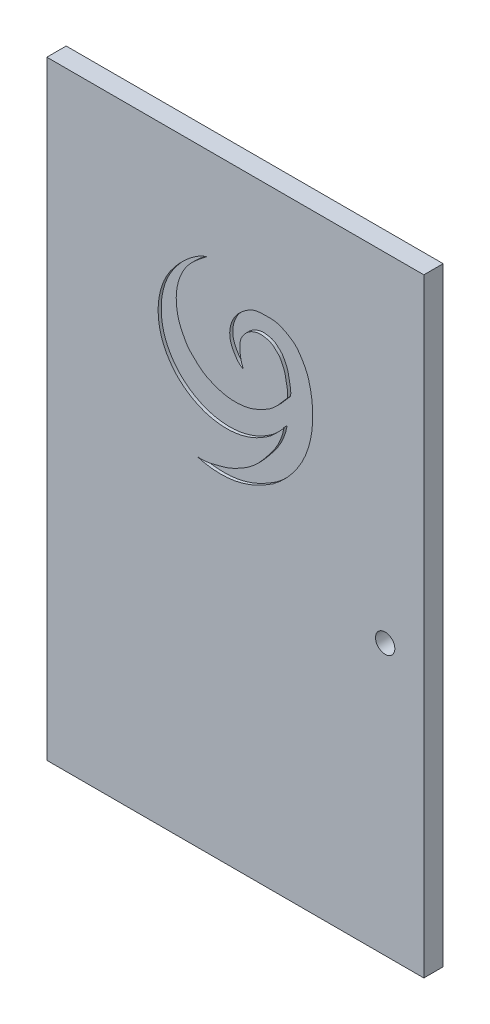
ISO-10303-21;
HEADER;
FILE_DESCRIPTION(('STEP AP214'),'2;1');
FILE_NAME('part.step','',(''),(''),'','','');
FILE_SCHEMA(('AUTOMOTIVE_DESIGN { 1 0 10303 214 1 1 1 1 }'));
ENDSEC;
DATA;
#1=APPLICATION_CONTEXT('core data for automotive mechanical design processes');
#2=APPLICATION_PROTOCOL_DEFINITION('international standard','automotive_design',2000,#1);
#3=PRODUCT_CONTEXT('',#1,'mechanical');
#4=PRODUCT('Part','Part','',(#3));
#5=PRODUCT_RELATED_PRODUCT_CATEGORY('part','',(#4));
#6=PRODUCT_DEFINITION_FORMATION('','',#4);
#7=PRODUCT_DEFINITION_CONTEXT('part definition',#1,'design');
#8=PRODUCT_DEFINITION('design','',#6,#7);
#9=PRODUCT_DEFINITION_SHAPE('','',#8);
#10=(LENGTH_UNIT() NAMED_UNIT(*) SI_UNIT(.MILLI.,.METRE.));
#11=(NAMED_UNIT(*) PLANE_ANGLE_UNIT() SI_UNIT($,.RADIAN.));
#12=(NAMED_UNIT(*) SI_UNIT($,.STERADIAN.) SOLID_ANGLE_UNIT());
#13=UNCERTAINTY_MEASURE_WITH_UNIT(LENGTH_MEASURE(1.E-05),#10,'distance_accuracy_value','');
#14=(GEOMETRIC_REPRESENTATION_CONTEXT(3) GLOBAL_UNCERTAINTY_ASSIGNED_CONTEXT((#13)) GLOBAL_UNIT_ASSIGNED_CONTEXT((#10,
#11,#12)) REPRESENTATION_CONTEXT('',''));
#15=CARTESIAN_POINT('',(0.,0.,0.));
#16=DIRECTION('',(0.,0.,1.));
#17=DIRECTION('',(1.,0.,0.));
#18=AXIS2_PLACEMENT_3D('',#15,#16,#17);
#19=CARTESIAN_POINT('',(-61.9125,200.025,6.35));
#20=DIRECTION('',(1.,0.,0.));
#21=DIRECTION('',(0.,0.,-1.));
#22=AXIS2_PLACEMENT_3D('',#19,#20,#21);
#23=PLANE('',#22);
#24=DIRECTION('',(0.,-1.,0.));
#25=VECTOR('',#24,1.);
#26=CARTESIAN_POINT('',(-61.9125,200.025,0.));
#27=LINE('',#26,#25);
#28=CARTESIAN_POINT('',(-61.9125,200.025,0.));
#29=VERTEX_POINT('',#28);
#30=CARTESIAN_POINT('',(-61.9125,0.,0.));
#31=VERTEX_POINT('',#30);
#32=EDGE_CURVE('E186',#29,#31,#27,.T.);
#33=ORIENTED_EDGE('',*,*,#32,.T.);
#34=DIRECTION('',(0.,0.,-1.));
#35=VECTOR('',#34,1.);
#36=CARTESIAN_POINT('',(-61.9125,0.,6.35));
#37=LINE('',#36,#35);
#38=CARTESIAN_POINT('',(-61.9125,0.,6.35));
#39=VERTEX_POINT('',#38);
#40=EDGE_CURVE('E11',#39,#31,#37,.T.);
#41=ORIENTED_EDGE('',*,*,#40,.F.);
#42=DIRECTION('',(0.,-1.,0.));
#43=VECTOR('',#42,1.);
#44=CARTESIAN_POINT('',(-61.9125,200.025,6.35));
#45=LINE('',#44,#43);
#46=CARTESIAN_POINT('',(-61.9125,200.025,6.35));
#47=VERTEX_POINT('',#46);
#48=EDGE_CURVE('E192',#47,#39,#45,.T.);
#49=ORIENTED_EDGE('',*,*,#48,.F.);
#50=DIRECTION('',(0.,0.,-1.));
#51=VECTOR('',#50,1.);
#52=CARTESIAN_POINT('',(-61.9125,200.025,6.35));
#53=LINE('',#52,#51);
#54=EDGE_CURVE('E196',#47,#29,#53,.T.);
#55=ORIENTED_EDGE('',*,*,#54,.T.);
#56=EDGE_LOOP('',(#33,#41,#49,#55));
#57=FACE_BOUND('',#56,.T.);
#58=ADVANCED_FACE('F33',(#57),#23,.F.);
#59=CARTESIAN_POINT('',(-61.9125,0.,6.35));
#60=DIRECTION('',(0.,1.,0.));
#61=DIRECTION('',(0.,0.,1.));
#62=AXIS2_PLACEMENT_3D('',#59,#60,#61);
#63=PLANE('',#62);
#64=DIRECTION('',(1.,0.,0.));
#65=VECTOR('',#64,1.);
#66=CARTESIAN_POINT('',(-61.9125,0.,0.));
#67=LINE('',#66,#65);
#68=CARTESIAN_POINT('',(61.9125,0.,0.));
#69=VERTEX_POINT('',#68);
#70=EDGE_CURVE('E177',#31,#69,#67,.T.);
#71=ORIENTED_EDGE('',*,*,#70,.T.);
#72=DIRECTION('',(0.,0.,-1.));
#73=VECTOR('',#72,1.);
#74=CARTESIAN_POINT('',(61.9125,0.,6.35));
#75=LINE('',#74,#73);
#76=CARTESIAN_POINT('',(61.9125,0.,6.35));
#77=VERTEX_POINT('',#76);
#78=EDGE_CURVE('E40',#77,#69,#75,.T.);
#79=ORIENTED_EDGE('',*,*,#78,.F.);
#80=DIRECTION('',(1.,0.,0.));
#81=VECTOR('',#80,1.);
#82=CARTESIAN_POINT('',(-61.9125,0.,6.35));
#83=LINE('',#82,#81);
#84=EDGE_CURVE('E84',#39,#77,#83,.T.);
#85=ORIENTED_EDGE('',*,*,#84,.F.);
#86=ORIENTED_EDGE('',*,*,#40,.T.);
#87=EDGE_LOOP('',(#71,#79,#85,#86));
#88=FACE_BOUND('',#87,.T.);
#89=ADVANCED_FACE('F170',(#88),#63,.F.);
#90=CARTESIAN_POINT('',(61.9125,200.025,6.35));
#91=DIRECTION('',(-1.,0.,0.));
#92=DIRECTION('',(0.,-1.,0.));
#93=AXIS2_PLACEMENT_3D('',#90,#91,#92);
#94=PLANE('',#93);
#95=DIRECTION('',(0.,1.,0.));
#96=VECTOR('',#95,1.);
#97=CARTESIAN_POINT('',(61.9125,200.025,0.));
#98=LINE('',#97,#96);
#99=CARTESIAN_POINT('',(61.9125,200.025,0.));
#100=VERTEX_POINT('',#99);
#101=EDGE_CURVE('E185',#69,#100,#98,.T.);
#102=ORIENTED_EDGE('',*,*,#101,.T.);
#103=DIRECTION('',(0.,0.,-1.));
#104=VECTOR('',#103,1.);
#105=CARTESIAN_POINT('',(61.9125,200.025,6.35));
#106=LINE('',#105,#104);
#107=CARTESIAN_POINT('',(61.9125,200.025,6.35));
#108=VERTEX_POINT('',#107);
#109=EDGE_CURVE('E190',#108,#100,#106,.T.);
#110=ORIENTED_EDGE('',*,*,#109,.F.);
#111=DIRECTION('',(0.,1.,0.));
#112=VECTOR('',#111,1.);
#113=CARTESIAN_POINT('',(61.9125,200.025,6.35));
#114=LINE('',#113,#112);
#115=EDGE_CURVE('E189',#77,#108,#114,.T.);
#116=ORIENTED_EDGE('',*,*,#115,.F.);
#117=ORIENTED_EDGE('',*,*,#78,.T.);
#118=EDGE_LOOP('',(#102,#110,#116,#117));
#119=FACE_BOUND('',#118,.T.);
#120=ADVANCED_FACE('F168',(#119),#94,.F.);
#121=CARTESIAN_POINT('',(-61.9125,200.025,6.35));
#122=DIRECTION('',(0.,-1.,0.));
#123=DIRECTION('',(0.,0.,-1.));
#124=AXIS2_PLACEMENT_3D('',#121,#122,#123);
#125=PLANE('',#124);
#126=DIRECTION('',(-1.,0.,0.));
#127=VECTOR('',#126,1.);
#128=CARTESIAN_POINT('',(-61.9125,200.025,0.));
#129=LINE('',#128,#127);
#130=EDGE_CURVE('E77',#100,#29,#129,.T.);
#131=ORIENTED_EDGE('',*,*,#130,.T.);
#132=ORIENTED_EDGE('',*,*,#54,.F.);
#133=DIRECTION('',(-1.,0.,0.));
#134=VECTOR('',#133,1.);
#135=CARTESIAN_POINT('',(-61.9125,200.025,6.35));
#136=LINE('',#135,#134);
#137=EDGE_CURVE('E56',#108,#47,#136,.T.);
#138=ORIENTED_EDGE('',*,*,#137,.F.);
#139=ORIENTED_EDGE('',*,*,#109,.T.);
#140=EDGE_LOOP('',(#131,#132,#138,#139));
#141=FACE_BOUND('',#140,.T.);
#142=ADVANCED_FACE('F161',(#141),#125,.F.);
#143=CARTESIAN_POINT('',(0.,0.,6.35));
#144=DIRECTION('',(0.,0.,1.));
#145=DIRECTION('',(1.,0.,0.));
#146=AXIS2_PLACEMENT_3D('',#143,#144,#145);
#147=PLANE('',#146);
#148=CARTESIAN_POINT('',(49.2125,88.9,6.35));
#149=DIRECTION('',(0.,0.,1.));
#150=DIRECTION('',(1.,0.,0.));
#151=AXIS2_PLACEMENT_3D('',#148,#149,#150);
#152=CIRCLE('',#151,3.175);
#153=CARTESIAN_POINT('',(52.3875,88.9,6.35));
#154=VERTEX_POINT('',#153);
#155=EDGE_CURVE('E142',#154,#154,#152,.T.);
#156=ORIENTED_EDGE('',*,*,#155,.F.);
#157=EDGE_LOOP('',(#156));
#158=FACE_BOUND('',#157,.T.);
#159=CARTESIAN_POINT('',(-9.33151369999992,169.569243244818,6.35));
#160=CARTESIAN_POINT('',(-11.3441630700912,168.928938218158,6.35));
#161=CARTESIAN_POINT('',(-15.1359253544228,166.486952880021,6.35));
#162=CARTESIAN_POINT('',(-19.6225901377534,162.033808821089,6.35));
#163=CARTESIAN_POINT('',(-23.0505074323337,157.045363774663,6.35));
#164=CARTESIAN_POINT('',(-25.9034409284941,149.142146475525,6.35));
#165=CARTESIAN_POINT('',(-25.4328901723913,140.742158425585,6.35));
#166=CARTESIAN_POINT('',(-21.9081654075975,134.091041706395,6.35));
#167=CARTESIAN_POINT('',(-19.2142506878481,130.610000296154,6.35));
#168=CARTESIAN_POINT('',(-14.8988789196288,127.064106492967,6.35));
#169=CARTESIAN_POINT('',(-9.41137856409758,124.519214898327,6.35));
#170=CARTESIAN_POINT('',(-4.09154609957028,123.798546407445,6.35));
#171=CARTESIAN_POINT('',(0.241003836470567,124.010205105227,6.35));
#172=CARTESIAN_POINT('',(3.8006439784204,124.813352957057,6.35));
#173=CARTESIAN_POINT('',(7.11298866803132,126.179760231291,6.35));
#174=CARTESIAN_POINT('',(9.59766915761153,127.664469948106,6.35));
#175=CARTESIAN_POINT('',(11.6647320976224,129.010614657323,6.35));
#176=CARTESIAN_POINT('',(13.7295227272087,131.070185150199,6.35));
#177=CARTESIAN_POINT('',(15.2847511671069,132.546381486298,6.35));
#178=CARTESIAN_POINT('',(16.0214802698775,133.680133599882,6.35));
#179=B_SPLINE_CURVE_WITH_KNOTS('',3,(#159,#160,#161,#162,#163,#164,#165,#166,#167,#168,#169,
#170,#171,#172,#173,#174,#175,#176,#177,#178),.UNSPECIFIED.,.F.,.F.,(4,1,1,1,1,1,1,1,1,1,1,1,1,
1,1,1,1,4),(0.,0.072307291664257,0.154021228623457,0.217048286258904,0.279451888216032,
0.442511381417524,0.485075123876119,0.538693378530023,0.593269747740577,0.676632218523672,
0.743784183035144,0.776508439751407,0.826079505813999,0.868929023905676,0.899620041044802,
0.925997355273273,0.953773621776259,1.),.UNSPECIFIED.);
#180=CARTESIAN_POINT('',(-9.33151369999992,169.569243244818,6.35));
#181=VERTEX_POINT('',#180);
#182=CARTESIAN_POINT('',(16.0214802698775,133.680133599882,6.35));
#183=VERTEX_POINT('',#182);
#184=EDGE_CURVE('E47',#181,#183,#179,.T.);
#185=ORIENTED_EDGE('',*,*,#184,.F.);
#186=CARTESIAN_POINT('',(17.1481159815231,142.599332983744,6.35));
#187=CARTESIAN_POINT('',(15.4193309596214,140.673664775958,6.35));
#188=CARTESIAN_POINT('',(13.1590457875216,137.534995882457,6.35));
#189=CARTESIAN_POINT('',(8.76228438500476,135.063456783887,6.35));
#190=CARTESIAN_POINT('',(5.39237554030609,133.515486042035,6.35));
#191=CARTESIAN_POINT('',(1.51942173358514,132.841261275514,6.35));
#192=CARTESIAN_POINT('',(-2.04778644475218,132.89763956406,6.35));
#193=CARTESIAN_POINT('',(-5.18530482191121,133.615581719792,6.35));
#194=CARTESIAN_POINT('',(-7.85361351160307,134.599615465438,6.35));
#195=CARTESIAN_POINT('',(-10.0772567063634,135.67885628137,6.35));
#196=CARTESIAN_POINT('',(-11.8362573378021,136.982177805117,6.35));
#197=CARTESIAN_POINT('',(-13.5886423059242,138.679050763649,6.35));
#198=CARTESIAN_POINT('',(-15.6440345842387,140.599586863543,6.35));
#199=CARTESIAN_POINT('',(-17.1241827116559,143.444668774535,6.35));
#200=CARTESIAN_POINT('',(-18.4698222414768,146.121874650492,6.35));
#201=CARTESIAN_POINT('',(-19.3582358310202,149.934925707502,6.35));
#202=CARTESIAN_POINT('',(-19.5700803096068,154.001795445731,6.35));
#203=CARTESIAN_POINT('',(-18.7447721022291,157.978250350046,6.35));
#204=CARTESIAN_POINT('',(-17.3515286998208,161.554482649609,6.35));
#205=CARTESIAN_POINT('',(-14.4737088182786,165.721233018863,6.35));
#206=CARTESIAN_POINT('',(-11.197682458428,168.097691300216,6.35));
#207=CARTESIAN_POINT('',(-9.33151369999992,169.569243244818,6.35));
#208=B_SPLINE_CURVE_WITH_KNOTS('',3,(#186,#187,#188,#189,#190,#191,#192,#193,#194,#195,#196,
#197,#198,#199,#200,#201,#202,#203,#204,#205,#206,#207),.UNSPECIFIED.,.F.,.F.,(4,1,1,1,1,1,1,1,
1,1,1,1,1,1,1,1,1,1,1,4),(0.,0.11035948708457,0.155195539306715,0.209754150570665,
0.264797675006218,0.318061272021364,0.357981694436805,0.398821332997025,0.436942944782944,
0.460901999340663,0.490019193503069,0.539162841046372,0.577129726129265,0.623245717830765,
0.664159811313516,0.739994840442848,0.791550521821745,0.832894971239135,0.900038091444018,1.),.UNSPECIFIED.);
#209=CARTESIAN_POINT('',(17.1481159815231,142.599332983744,6.35));
#210=VERTEX_POINT('',#209);
#211=EDGE_CURVE('E133',#210,#181,#208,.T.);
#212=ORIENTED_EDGE('',*,*,#211,.F.);
#213=CARTESIAN_POINT('',(2.59573803943399,143.569491513216,6.35));
#214=CARTESIAN_POINT('',(1.84694368008702,145.341424213551,6.35));
#215=CARTESIAN_POINT('',(1.37134617449232,147.894578102409,6.35));
#216=CARTESIAN_POINT('',(1.51654828247539,151.083064738109,6.35));
#217=CARTESIAN_POINT('',(2.26494333448947,152.806256443375,6.35));
#218=CARTESIAN_POINT('',(3.3305584512329,154.147368605432,6.35));
#219=CARTESIAN_POINT('',(4.65296589512038,155.265249531002,6.35));
#220=CARTESIAN_POINT('',(6.20380664116433,155.978162130256,6.35));
#221=CARTESIAN_POINT('',(7.81739679178824,156.396871018346,6.35));
#222=CARTESIAN_POINT('',(9.68382125817044,156.193574809739,6.35));
#223=CARTESIAN_POINT('',(11.7455683685271,155.781281157334,6.35));
#224=CARTESIAN_POINT('',(13.240823028224,154.375565068778,6.35));
#225=CARTESIAN_POINT('',(14.5130191786366,153.196973860548,6.35));
#226=CARTESIAN_POINT('',(15.2570469914294,151.7284493537,6.35));
#227=CARTESIAN_POINT('',(16.2785179895224,149.765590011772,6.35));
#228=CARTESIAN_POINT('',(16.7335117020684,146.581109303353,6.35));
#229=CARTESIAN_POINT('',(17.3675648981288,144.138708690494,6.35));
#230=CARTESIAN_POINT('',(17.1481159815231,142.599332983744,6.35));
#231=B_SPLINE_CURVE_WITH_KNOTS('',3,(#213,#214,#215,#216,#217,#218,#219,#220,#221,#222,#223,
#224,#225,#226,#227,#228,#229,#230),.UNSPECIFIED.,.F.,.F.,(4,1,1,1,1,1,1,1,1,1,1,1,1,1,1,4),(0.,
0.163217353487181,0.222081243175168,0.270701371211503,0.321811887317675,0.368302362701194,
0.418025869660323,0.467619888100255,0.508948236800199,0.578774658822401,0.642624262864001,
0.68130028253911,0.727120291757595,0.782473784798675,0.870772513963501,1.),.UNSPECIFIED.);
#232=CARTESIAN_POINT('',(2.59573803943399,143.569491513216,6.35));
#233=VERTEX_POINT('',#232);
#234=EDGE_CURVE('E136',#233,#210,#231,.T.);
#235=ORIENTED_EDGE('',*,*,#234,.F.);
#236=CARTESIAN_POINT('',(-12.4800997035039,111.116416453111,6.35));
#237=CARTESIAN_POINT('',(-10.1081372673109,110.358818404886,6.35));
#238=CARTESIAN_POINT('',(-5.99782352615152,109.821254188531,6.35));
#239=CARTESIAN_POINT('',(-0.597926715302622,110.157178983742,6.35));
#240=CARTESIAN_POINT('',(3.29271755873632,111.195822904681,6.35));
#241=CARTESIAN_POINT('',(6.51066462091854,112.417594107758,6.35));
#242=CARTESIAN_POINT('',(9.62842520089272,114.075558071013,6.35));
#243=CARTESIAN_POINT('',(12.4954708457742,115.7687945089,6.35));
#244=CARTESIAN_POINT('',(14.7652474223979,117.697271945716,6.35));
#245=CARTESIAN_POINT('',(16.7694014067029,119.576261489369,6.35));
#246=CARTESIAN_POINT('',(18.863141262347,122.066101255206,6.35));
#247=CARTESIAN_POINT('',(21.1650813249845,125.256739902965,6.35));
#248=CARTESIAN_POINT('',(23.0785710984485,129.062371921986,6.35));
#249=CARTESIAN_POINT('',(24.6277320780294,133.635659830278,6.35));
#250=CARTESIAN_POINT('',(25.7354185934986,140.388419647306,6.35));
#251=CARTESIAN_POINT('',(25.241855425162,147.24074559072,6.35));
#252=CARTESIAN_POINT('',(23.6508906248369,153.012737550771,6.35));
#253=CARTESIAN_POINT('',(21.7827770668223,156.302763768479,6.35));
#254=CARTESIAN_POINT('',(19.9546022435954,158.976975504642,6.35));
#255=CARTESIAN_POINT('',(17.093369221222,160.810637860043,6.35));
#256=CARTESIAN_POINT('',(14.0261765527272,162.441587137962,6.35));
#257=CARTESIAN_POINT('',(9.7789438714059,162.556297830842,6.35));
#258=CARTESIAN_POINT('',(6.05322592317505,162.324329439953,6.35));
#259=CARTESIAN_POINT('',(2.98426018566071,160.391278638994,6.35));
#260=CARTESIAN_POINT('',(0.573453598387242,158.349369243065,6.35));
#261=CARTESIAN_POINT('',(-1.34757129446458,155.19152362283,6.35));
#262=CARTESIAN_POINT('',(-2.04700833205815,151.877245630493,6.35));
#263=CARTESIAN_POINT('',(-1.58321292743859,149.064413700657,6.35));
#264=CARTESIAN_POINT('',(-0.219261635708103,146.215388888177,6.35));
#265=CARTESIAN_POINT('',(1.09126042526772,144.310158379045,6.35));
#266=CARTESIAN_POINT('',(2.59573803943399,143.569491513216,6.35));
#267=B_SPLINE_CURVE_WITH_KNOTS('',3,(#236,#237,#238,#239,#240,#241,#242,#243,#244,#245,#246,
#247,#248,#249,#250,#251,#252,#253,#254,#255,#256,#257,#258,#259,#260,#261,#262,#263,#264,#265,
#266),.UNSPECIFIED.,.F.,.F.,(4,1,1,1,1,1,1,1,1,1,1,1,1,1,1,1,1,1,1,1,1,1,1,1,1,1,1,1,4),(0.,
0.0659961999887047,0.10949266144066,0.143035820124365,0.172778055109202,0.200885574430696,
0.236942623005262,0.261064980656383,0.279971331356747,0.310000551033426,0.347462777183123,
0.384427553007412,0.422879290220614,0.475572403838394,0.56551344132523,0.603338663646277,
0.633598050924986,0.666155925866293,0.687761528116204,0.723466714889376,0.756557310152796,
0.799625001369175,0.819547010631871,0.851903026978172,0.883034817083469,0.916135419579191,
0.939775314491581,0.957419732032875,1.),.UNSPECIFIED.);
#268=CARTESIAN_POINT('',(-12.4800997035039,111.116416453111,6.35));
#269=VERTEX_POINT('',#268);
#270=EDGE_CURVE('E217',#269,#233,#267,.T.);
#271=ORIENTED_EDGE('',*,*,#270,.F.);
#272=CARTESIAN_POINT('',(16.0214802698775,133.680133599882,6.35));
#273=CARTESIAN_POINT('',(15.5476429048634,130.861311443134,6.35));
#274=CARTESIAN_POINT('',(13.7747553112942,126.773576411937,6.35));
#275=CARTESIAN_POINT('',(9.96461723499605,122.001460333526,6.35));
#276=CARTESIAN_POINT('',(6.57664689870528,117.974608302891,6.35));
#277=CARTESIAN_POINT('',(2.16491122966873,115.032216309467,6.35));
#278=CARTESIAN_POINT('',(-1.98778410997105,112.975517751186,6.35));
#279=CARTESIAN_POINT('',(-6.76650479057713,111.676958112147,6.35));
#280=CARTESIAN_POINT('',(-10.1295093405152,110.851795977496,6.35));
#281=CARTESIAN_POINT('',(-12.4800997035039,111.116416453111,6.35));
#282=B_SPLINE_CURVE_WITH_KNOTS('',3,(#272,#273,#274,#275,#276,#277,#278,#279,#280,#281),
.UNSPECIFIED.,.F.,.F.,(4,1,1,1,1,1,1,4),(0.,0.219377616168943,0.33204459572276,
0.469048069703984,0.620726317531509,0.734986018543533,0.823255722853543,1.),.UNSPECIFIED.);
#283=EDGE_CURVE('E219',#183,#269,#282,.T.);
#284=ORIENTED_EDGE('',*,*,#283,.F.);
#285=EDGE_LOOP('',(#185,#212,#235,#271,#284));
#286=FACE_BOUND('',#285,.T.);
#287=ORIENTED_EDGE('',*,*,#48,.T.);
#288=ORIENTED_EDGE('',*,*,#84,.T.);
#289=ORIENTED_EDGE('',*,*,#115,.T.);
#290=ORIENTED_EDGE('',*,*,#137,.T.);
#291=EDGE_LOOP('',(#287,#288,#289,#290));
#292=FACE_BOUND('',#291,.T.);
#293=ADVANCED_FACE('F158',(#158,#286,#292),#147,.T.);
#294=CARTESIAN_POINT('',(0.,0.,0.));
#295=DIRECTION('',(0.,0.,1.));
#296=DIRECTION('',(1.,0.,0.));
#297=AXIS2_PLACEMENT_3D('',#294,#295,#296);
#298=PLANE('',#297);
#299=CARTESIAN_POINT('',(49.2125,88.9,0.));
#300=DIRECTION('',(0.,0.,1.));
#301=DIRECTION('',(1.,0.,0.));
#302=AXIS2_PLACEMENT_3D('',#299,#300,#301);
#303=CIRCLE('',#302,3.175);
#304=CARTESIAN_POINT('',(52.3875,88.9,0.));
#305=VERTEX_POINT('',#304);
#306=EDGE_CURVE('E291',#305,#305,#303,.T.);
#307=ORIENTED_EDGE('',*,*,#306,.T.);
#308=EDGE_LOOP('',(#307));
#309=FACE_BOUND('',#308,.T.);
#310=ORIENTED_EDGE('',*,*,#32,.F.);
#311=ORIENTED_EDGE('',*,*,#130,.F.);
#312=ORIENTED_EDGE('',*,*,#101,.F.);
#313=ORIENTED_EDGE('',*,*,#70,.F.);
#314=EDGE_LOOP('',(#310,#311,#312,#313));
#315=FACE_BOUND('',#314,.T.);
#316=ADVANCED_FACE('F156',(#309,#315),#298,.F.);
#317=CARTESIAN_POINT('',(-9.33151369999992,169.569243244818,5.35));
#318=CARTESIAN_POINT('',(-11.3441630700912,168.928938218158,5.35));
#319=CARTESIAN_POINT('',(-15.1359253544228,166.486952880021,5.35));
#320=CARTESIAN_POINT('',(-19.6225901377534,162.033808821089,5.35));
#321=CARTESIAN_POINT('',(-23.0505074323337,157.045363774663,5.35));
#322=CARTESIAN_POINT('',(-25.9034409284941,149.142146475525,5.35));
#323=CARTESIAN_POINT('',(-25.4328901723913,140.742158425585,5.35));
#324=CARTESIAN_POINT('',(-21.9081654075975,134.091041706395,5.35));
#325=CARTESIAN_POINT('',(-19.2142506878481,130.610000296154,5.35));
#326=CARTESIAN_POINT('',(-14.8988789196288,127.064106492967,5.35));
#327=CARTESIAN_POINT('',(-9.41137856409758,124.519214898327,5.35));
#328=CARTESIAN_POINT('',(-4.09154609957028,123.798546407445,5.35));
#329=CARTESIAN_POINT('',(0.241003836470567,124.010205105227,5.35));
#330=CARTESIAN_POINT('',(3.8006439784204,124.813352957057,5.35));
#331=CARTESIAN_POINT('',(7.11298866803132,126.179760231291,5.35));
#332=CARTESIAN_POINT('',(9.59766915761153,127.664469948106,5.35));
#333=CARTESIAN_POINT('',(11.6647320976224,129.010614657323,5.35));
#334=CARTESIAN_POINT('',(13.7295227272087,131.070185150199,5.35));
#335=CARTESIAN_POINT('',(15.2847511671069,132.546381486298,5.35));
#336=CARTESIAN_POINT('',(16.0214802698775,133.680133599882,5.35));
#337=B_SPLINE_CURVE_WITH_KNOTS('',3,(#317,#318,#319,#320,#321,#322,#323,#324,#325,#326,#327,
#328,#329,#330,#331,#332,#333,#334,#335,#336),.UNSPECIFIED.,.F.,.F.,(4,1,1,1,1,1,1,1,1,1,1,1,1,
1,1,1,1,4),(0.,0.072307291664257,0.154021228623457,0.217048286258904,0.279451888216032,
0.442511381417524,0.485075123876119,0.538693378530023,0.593269747740577,0.676632218523672,
0.743784183035144,0.776508439751407,0.826079505813999,0.868929023905676,0.899620041044802,
0.925997355273273,0.953773621776259,1.),.UNSPECIFIED.);
#338=DIRECTION('',(0.,0.,1.));
#339=VECTOR('',#338,1.);
#340=SURFACE_OF_LINEAR_EXTRUSION('',#337,#339);
#341=ORIENTED_EDGE('',*,*,#184,.T.);
#342=DIRECTION('',(0.,0.,1.));
#343=VECTOR('',#342,1.);
#344=CARTESIAN_POINT('',(16.0214802698775,133.680133599882,5.35));
#345=LINE('',#344,#343);
#346=CARTESIAN_POINT('',(16.0214802698775,133.680133599882,5.35));
#347=VERTEX_POINT('',#346);
#348=EDGE_CURVE('E110',#347,#183,#345,.T.);
#349=ORIENTED_EDGE('',*,*,#348,.F.);
#350=CARTESIAN_POINT('',(-9.33151369999992,169.569243244818,5.35));
#351=VERTEX_POINT('',#350);
#352=EDGE_CURVE('E114',#351,#347,#337,.T.);
#353=ORIENTED_EDGE('',*,*,#352,.F.);
#354=DIRECTION('',(0.,0.,1.));
#355=VECTOR('',#354,1.);
#356=CARTESIAN_POINT('',(-9.33151369999992,169.569243244818,5.35));
#357=LINE('',#356,#355);
#358=EDGE_CURVE('E202',#351,#181,#357,.T.);
#359=ORIENTED_EDGE('',*,*,#358,.T.);
#360=EDGE_LOOP('',(#341,#349,#353,#359));
#361=FACE_BOUND('',#360,.T.);
#362=ADVANCED_FACE('F112',(#361),#340,.F.);
#363=CARTESIAN_POINT('',(17.1481159815231,142.599332983744,5.35));
#364=CARTESIAN_POINT('',(15.4193309596214,140.673664775958,5.35));
#365=CARTESIAN_POINT('',(13.1590457875216,137.534995882457,5.35));
#366=CARTESIAN_POINT('',(8.76228438500476,135.063456783887,5.35));
#367=CARTESIAN_POINT('',(5.39237554030609,133.515486042035,5.35));
#368=CARTESIAN_POINT('',(1.51942173358514,132.841261275514,5.35));
#369=CARTESIAN_POINT('',(-2.04778644475218,132.89763956406,5.35));
#370=CARTESIAN_POINT('',(-5.18530482191121,133.615581719792,5.35));
#371=CARTESIAN_POINT('',(-7.85361351160307,134.599615465438,5.35));
#372=CARTESIAN_POINT('',(-10.0772567063634,135.67885628137,5.35));
#373=CARTESIAN_POINT('',(-11.8362573378021,136.982177805117,5.35));
#374=CARTESIAN_POINT('',(-13.5886423059242,138.679050763649,5.35));
#375=CARTESIAN_POINT('',(-15.6440345842387,140.599586863543,5.35));
#376=CARTESIAN_POINT('',(-17.1241827116559,143.444668774535,5.35));
#377=CARTESIAN_POINT('',(-18.4698222414768,146.121874650492,5.35));
#378=CARTESIAN_POINT('',(-19.3582358310202,149.934925707502,5.35));
#379=CARTESIAN_POINT('',(-19.5700803096068,154.001795445731,5.35));
#380=CARTESIAN_POINT('',(-18.7447721022291,157.978250350046,5.35));
#381=CARTESIAN_POINT('',(-17.3515286998208,161.554482649609,5.35));
#382=CARTESIAN_POINT('',(-14.4737088182786,165.721233018863,5.35));
#383=CARTESIAN_POINT('',(-11.197682458428,168.097691300216,5.35));
#384=CARTESIAN_POINT('',(-9.33151369999992,169.569243244818,5.35));
#385=B_SPLINE_CURVE_WITH_KNOTS('',3,(#363,#364,#365,#366,#367,#368,#369,#370,#371,#372,#373,
#374,#375,#376,#377,#378,#379,#380,#381,#382,#383,#384),.UNSPECIFIED.,.F.,.F.,(4,1,1,1,1,1,1,1,
1,1,1,1,1,1,1,1,1,1,1,4),(0.,0.11035948708457,0.155195539306715,0.209754150570665,
0.264797675006218,0.318061272021364,0.357981694436805,0.398821332997025,0.436942944782944,
0.460901999340663,0.490019193503069,0.539162841046372,0.577129726129265,0.623245717830765,
0.664159811313516,0.739994840442848,0.791550521821745,0.832894971239135,0.900038091444018,1.),.UNSPECIFIED.);
#386=DIRECTION('',(0.,0.,1.));
#387=VECTOR('',#386,1.);
#388=SURFACE_OF_LINEAR_EXTRUSION('',#385,#387);
#389=ORIENTED_EDGE('',*,*,#211,.T.);
#390=ORIENTED_EDGE('',*,*,#358,.F.);
#391=CARTESIAN_POINT('',(17.1481159815231,142.599332983744,5.35));
#392=VERTEX_POINT('',#391);
#393=EDGE_CURVE('E120',#392,#351,#385,.T.);
#394=ORIENTED_EDGE('',*,*,#393,.F.);
#395=DIRECTION('',(0.,0.,1.));
#396=VECTOR('',#395,1.);
#397=CARTESIAN_POINT('',(17.1481159815231,142.599332983744,5.35));
#398=LINE('',#397,#396);
#399=EDGE_CURVE('E203',#392,#210,#398,.T.);
#400=ORIENTED_EDGE('',*,*,#399,.T.);
#401=EDGE_LOOP('',(#389,#390,#394,#400));
#402=FACE_BOUND('',#401,.T.);
#403=ADVANCED_FACE('F155',(#402),#388,.F.);
#404=CARTESIAN_POINT('',(2.59573803943399,143.569491513216,5.35));
#405=CARTESIAN_POINT('',(1.84694368008702,145.341424213551,5.35));
#406=CARTESIAN_POINT('',(1.37134617449232,147.894578102409,5.35));
#407=CARTESIAN_POINT('',(1.51654828247539,151.083064738109,5.35));
#408=CARTESIAN_POINT('',(2.26494333448947,152.806256443375,5.35));
#409=CARTESIAN_POINT('',(3.3305584512329,154.147368605432,5.35));
#410=CARTESIAN_POINT('',(4.65296589512038,155.265249531002,5.35));
#411=CARTESIAN_POINT('',(6.20380664116433,155.978162130256,5.35));
#412=CARTESIAN_POINT('',(7.81739679178824,156.396871018346,5.35));
#413=CARTESIAN_POINT('',(9.68382125817044,156.193574809739,5.35));
#414=CARTESIAN_POINT('',(11.7455683685271,155.781281157334,5.35));
#415=CARTESIAN_POINT('',(13.240823028224,154.375565068778,5.35));
#416=CARTESIAN_POINT('',(14.5130191786366,153.196973860548,5.35));
#417=CARTESIAN_POINT('',(15.2570469914294,151.7284493537,5.35));
#418=CARTESIAN_POINT('',(16.2785179895224,149.765590011772,5.35));
#419=CARTESIAN_POINT('',(16.7335117020684,146.581109303353,5.35));
#420=CARTESIAN_POINT('',(17.3675648981288,144.138708690494,5.35));
#421=CARTESIAN_POINT('',(17.1481159815231,142.599332983744,5.35));
#422=B_SPLINE_CURVE_WITH_KNOTS('',3,(#404,#405,#406,#407,#408,#409,#410,#411,#412,#413,#414,
#415,#416,#417,#418,#419,#420,#421),.UNSPECIFIED.,.F.,.F.,(4,1,1,1,1,1,1,1,1,1,1,1,1,1,1,4),(0.,
0.163217353487181,0.222081243175168,0.270701371211503,0.321811887317675,0.368302362701194,
0.418025869660323,0.467619888100255,0.508948236800199,0.578774658822401,0.642624262864001,
0.68130028253911,0.727120291757595,0.782473784798675,0.870772513963501,1.),.UNSPECIFIED.);
#423=DIRECTION('',(0.,0.,1.));
#424=VECTOR('',#423,1.);
#425=SURFACE_OF_LINEAR_EXTRUSION('',#422,#424);
#426=ORIENTED_EDGE('',*,*,#234,.T.);
#427=ORIENTED_EDGE('',*,*,#399,.F.);
#428=CARTESIAN_POINT('',(2.59573803943399,143.569491513216,5.35));
#429=VERTEX_POINT('',#428);
#430=EDGE_CURVE('E251',#429,#392,#422,.T.);
#431=ORIENTED_EDGE('',*,*,#430,.F.);
#432=DIRECTION('',(0.,0.,1.));
#433=VECTOR('',#432,1.);
#434=CARTESIAN_POINT('',(2.59573803943399,143.569491513216,5.35));
#435=LINE('',#434,#433);
#436=EDGE_CURVE('E205',#429,#233,#435,.T.);
#437=ORIENTED_EDGE('',*,*,#436,.T.);
#438=EDGE_LOOP('',(#426,#427,#431,#437));
#439=FACE_BOUND('',#438,.T.);
#440=ADVANCED_FACE('F262',(#439),#425,.F.);
#441=CARTESIAN_POINT('',(-12.4800997035039,111.116416453111,5.35));
#442=CARTESIAN_POINT('',(-10.1081372673109,110.358818404886,5.35));
#443=CARTESIAN_POINT('',(-5.99782352615152,109.821254188531,5.35));
#444=CARTESIAN_POINT('',(-0.597926715302622,110.157178983742,5.35));
#445=CARTESIAN_POINT('',(3.29271755873632,111.195822904681,5.35));
#446=CARTESIAN_POINT('',(6.51066462091854,112.417594107758,5.35));
#447=CARTESIAN_POINT('',(9.62842520089272,114.075558071013,5.35));
#448=CARTESIAN_POINT('',(12.4954708457742,115.7687945089,5.35));
#449=CARTESIAN_POINT('',(14.7652474223979,117.697271945716,5.35));
#450=CARTESIAN_POINT('',(16.7694014067029,119.576261489369,5.35));
#451=CARTESIAN_POINT('',(18.863141262347,122.066101255206,5.35));
#452=CARTESIAN_POINT('',(21.1650813249845,125.256739902965,5.35));
#453=CARTESIAN_POINT('',(23.0785710984485,129.062371921986,5.35));
#454=CARTESIAN_POINT('',(24.6277320780294,133.635659830278,5.35));
#455=CARTESIAN_POINT('',(25.7354185934986,140.388419647306,5.35));
#456=CARTESIAN_POINT('',(25.241855425162,147.24074559072,5.35));
#457=CARTESIAN_POINT('',(23.6508906248369,153.012737550771,5.35));
#458=CARTESIAN_POINT('',(21.7827770668223,156.302763768479,5.35));
#459=CARTESIAN_POINT('',(19.9546022435954,158.976975504642,5.35));
#460=CARTESIAN_POINT('',(17.093369221222,160.810637860043,5.35));
#461=CARTESIAN_POINT('',(14.0261765527272,162.441587137962,5.35));
#462=CARTESIAN_POINT('',(9.7789438714059,162.556297830842,5.35));
#463=CARTESIAN_POINT('',(6.05322592317505,162.324329439953,5.35));
#464=CARTESIAN_POINT('',(2.98426018566071,160.391278638994,5.35));
#465=CARTESIAN_POINT('',(0.573453598387242,158.349369243065,5.35));
#466=CARTESIAN_POINT('',(-1.34757129446458,155.19152362283,5.35));
#467=CARTESIAN_POINT('',(-2.04700833205815,151.877245630493,5.35));
#468=CARTESIAN_POINT('',(-1.58321292743859,149.064413700657,5.35));
#469=CARTESIAN_POINT('',(-0.219261635708103,146.215388888177,5.35));
#470=CARTESIAN_POINT('',(1.09126042526772,144.310158379045,5.35));
#471=CARTESIAN_POINT('',(2.59573803943399,143.569491513216,5.35));
#472=B_SPLINE_CURVE_WITH_KNOTS('',3,(#441,#442,#443,#444,#445,#446,#447,#448,#449,#450,#451,
#452,#453,#454,#455,#456,#457,#458,#459,#460,#461,#462,#463,#464,#465,#466,#467,#468,#469,#470,
#471),.UNSPECIFIED.,.F.,.F.,(4,1,1,1,1,1,1,1,1,1,1,1,1,1,1,1,1,1,1,1,1,1,1,1,1,1,1,1,4),(0.,
0.0659961999887047,0.10949266144066,0.143035820124365,0.172778055109202,0.200885574430696,
0.236942623005262,0.261064980656383,0.279971331356747,0.310000551033426,0.347462777183123,
0.384427553007412,0.422879290220614,0.475572403838394,0.56551344132523,0.603338663646277,
0.633598050924986,0.666155925866293,0.687761528116204,0.723466714889376,0.756557310152796,
0.799625001369175,0.819547010631871,0.851903026978172,0.883034817083469,0.916135419579191,
0.939775314491581,0.957419732032875,1.),.UNSPECIFIED.);
#473=DIRECTION('',(0.,0.,1.));
#474=VECTOR('',#473,1.);
#475=SURFACE_OF_LINEAR_EXTRUSION('',#472,#474);
#476=ORIENTED_EDGE('',*,*,#270,.T.);
#477=ORIENTED_EDGE('',*,*,#436,.F.);
#478=CARTESIAN_POINT('',(-12.4800997035039,111.116416453111,5.35));
#479=VERTEX_POINT('',#478);
#480=EDGE_CURVE('E128',#479,#429,#472,.T.);
#481=ORIENTED_EDGE('',*,*,#480,.F.);
#482=DIRECTION('',(0.,0.,1.));
#483=VECTOR('',#482,1.);
#484=CARTESIAN_POINT('',(-12.4800997035039,111.116416453111,5.35));
#485=LINE('',#484,#483);
#486=EDGE_CURVE('E119',#479,#269,#485,.T.);
#487=ORIENTED_EDGE('',*,*,#486,.T.);
#488=EDGE_LOOP('',(#476,#477,#481,#487));
#489=FACE_BOUND('',#488,.T.);
#490=ADVANCED_FACE('F215',(#489),#475,.F.);
#491=CARTESIAN_POINT('',(16.0214802698775,133.680133599882,5.35));
#492=CARTESIAN_POINT('',(15.5476429048634,130.861311443134,5.35));
#493=CARTESIAN_POINT('',(13.7747553112942,126.773576411937,5.35));
#494=CARTESIAN_POINT('',(9.96461723499605,122.001460333526,5.35));
#495=CARTESIAN_POINT('',(6.57664689870528,117.974608302891,5.35));
#496=CARTESIAN_POINT('',(2.16491122966873,115.032216309467,5.35));
#497=CARTESIAN_POINT('',(-1.98778410997105,112.975517751186,5.35));
#498=CARTESIAN_POINT('',(-6.76650479057713,111.676958112147,5.35));
#499=CARTESIAN_POINT('',(-10.1295093405152,110.851795977496,5.35));
#500=CARTESIAN_POINT('',(-12.4800997035039,111.116416453111,5.35));
#501=B_SPLINE_CURVE_WITH_KNOTS('',3,(#491,#492,#493,#494,#495,#496,#497,#498,#499,#500),
.UNSPECIFIED.,.F.,.F.,(4,1,1,1,1,1,1,4),(0.,0.219377616168943,0.33204459572276,
0.469048069703984,0.620726317531509,0.734986018543533,0.823255722853543,1.),.UNSPECIFIED.);
#502=DIRECTION('',(0.,0.,1.));
#503=VECTOR('',#502,1.);
#504=SURFACE_OF_LINEAR_EXTRUSION('',#501,#503);
#505=ORIENTED_EDGE('',*,*,#283,.T.);
#506=ORIENTED_EDGE('',*,*,#486,.F.);
#507=EDGE_CURVE('E123',#347,#479,#501,.T.);
#508=ORIENTED_EDGE('',*,*,#507,.F.);
#509=ORIENTED_EDGE('',*,*,#348,.T.);
#510=EDGE_LOOP('',(#505,#506,#508,#509));
#511=FACE_BOUND('',#510,.T.);
#512=ADVANCED_FACE('F124',(#511),#504,.F.);
#513=CARTESIAN_POINT('',(-21.2549506866269,133.343884490267,5.35));
#514=DIRECTION('',(0.,0.,1.));
#515=DIRECTION('',(1.,0.,0.));
#516=AXIS2_PLACEMENT_3D('',#513,#514,#515);
#517=PLANE('',#516);
#518=ORIENTED_EDGE('',*,*,#352,.T.);
#519=ORIENTED_EDGE('',*,*,#507,.T.);
#520=ORIENTED_EDGE('',*,*,#480,.T.);
#521=ORIENTED_EDGE('',*,*,#430,.T.);
#522=ORIENTED_EDGE('',*,*,#393,.T.);
#523=EDGE_LOOP('',(#518,#519,#520,#521,#522));
#524=FACE_BOUND('',#523,.T.);
#525=ADVANCED_FACE('F130',(#524),#517,.T.);
#526=CARTESIAN_POINT('',(49.2125,88.9,15.3302561210691));
#527=DIRECTION('',(0.,0.,-1.));
#528=DIRECTION('',(-1.,0.,0.));
#529=AXIS2_PLACEMENT_3D('',#526,#527,#528);
#530=CYLINDRICAL_SURFACE('',#529,3.175);
#531=ORIENTED_EDGE('',*,*,#306,.F.);
#532=EDGE_LOOP('',(#531));
#533=FACE_BOUND('',#532,.T.);
#534=ORIENTED_EDGE('',*,*,#155,.T.);
#535=EDGE_LOOP('',(#534));
#536=FACE_BOUND('',#535,.T.);
#537=ADVANCED_FACE('F281',(#533,#536),#530,.F.);
#538=CLOSED_SHELL('',(#58,#89,#120,#142,#293,#316,#362,#403,#440,#490,#512,#525,#537));
#539=MANIFOLD_SOLID_BREP('B2',#538);
#540=ADVANCED_BREP_SHAPE_REPRESENTATION('',(#18,#539),#14);
#541=SHAPE_DEFINITION_REPRESENTATION(#9,#540);
ENDSEC;
END-ISO-10303-21;
